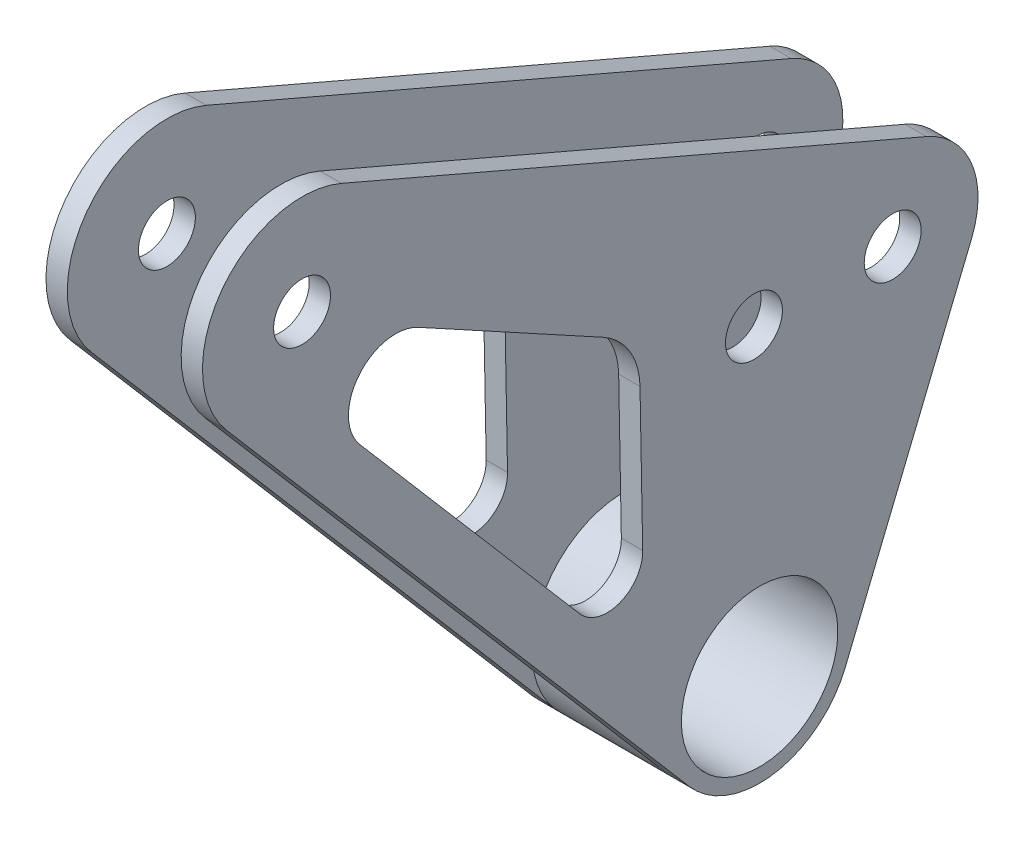
ISO-10303-21;
HEADER;
FILE_DESCRIPTION(('STEP AP214'),'2;1');
FILE_NAME('part.step','',(''),(''),'','','');
FILE_SCHEMA(('AUTOMOTIVE_DESIGN { 1 0 10303 214 1 1 1 1 }'));
ENDSEC;
DATA;
#1=APPLICATION_CONTEXT('core data for automotive mechanical design processes');
#2=APPLICATION_PROTOCOL_DEFINITION('international standard','automotive_design',2000,#1);
#3=PRODUCT_CONTEXT('',#1,'mechanical');
#4=PRODUCT('Part','Part','',(#3));
#5=PRODUCT_RELATED_PRODUCT_CATEGORY('part','',(#4));
#6=PRODUCT_DEFINITION_FORMATION('','',#4);
#7=PRODUCT_DEFINITION_CONTEXT('part definition',#1,'design');
#8=PRODUCT_DEFINITION('design','',#6,#7);
#9=PRODUCT_DEFINITION_SHAPE('','',#8);
#10=(LENGTH_UNIT() NAMED_UNIT(*) SI_UNIT(.MILLI.,.METRE.));
#11=(NAMED_UNIT(*) PLANE_ANGLE_UNIT() SI_UNIT($,.RADIAN.));
#12=(NAMED_UNIT(*) SI_UNIT($,.STERADIAN.) SOLID_ANGLE_UNIT());
#13=UNCERTAINTY_MEASURE_WITH_UNIT(LENGTH_MEASURE(1.E-05),#10,'distance_accuracy_value','');
#14=(GEOMETRIC_REPRESENTATION_CONTEXT(3) GLOBAL_UNCERTAINTY_ASSIGNED_CONTEXT((#13)) GLOBAL_UNIT_ASSIGNED_CONTEXT((#10,
#11,#12)) REPRESENTATION_CONTEXT('',''));
#15=CARTESIAN_POINT('',(0.,0.,0.));
#16=DIRECTION('',(0.,0.,1.));
#17=DIRECTION('',(1.,0.,0.));
#18=AXIS2_PLACEMENT_3D('',#15,#16,#17);
#19=CARTESIAN_POINT('',(698.53,233.678319405685,-100.647814507726));
#20=DIRECTION('',(0.,-0.918432058408451,0.395578758387778));
#21=DIRECTION('',(0.,-0.395578758387778,-0.918432058408451));
#22=AXIS2_PLACEMENT_3D('',#19,#20,#21);
#23=PLANE('',#22);
#24=DIRECTION('',(0.,-0.395578758387778,-0.918432058408451));
#25=VECTOR('',#24,1.);
#26=CARTESIAN_POINT('',(717.53,233.678319405685,-100.647814507726));
#27=LINE('',#26,#25);
#28=CARTESIAN_POINT('',(717.53,381.468048817716,242.481897382572));
#29=VERTEX_POINT('',#28);
#30=CARTESIAN_POINT('',(717.53,346.051184700902,160.253054899347));
#31=VERTEX_POINT('',#30);
#32=EDGE_CURVE('E436',#29,#31,#27,.T.);
#33=ORIENTED_EDGE('',*,*,#32,.F.);
#34=DIRECTION('',(1.,0.,0.));
#35=VECTOR('',#34,1.);
#36=CARTESIAN_POINT('',(698.53,381.468048817716,242.481897382572));
#37=LINE('',#36,#35);
#38=CARTESIAN_POINT('',(720.53,381.468048817716,242.481897382572));
#39=VERTEX_POINT('',#38);
#40=EDGE_CURVE('E439',#29,#39,#37,.T.);
#41=ORIENTED_EDGE('',*,*,#40,.T.);
#42=DIRECTION('',(0.,-0.395578758387778,-0.918432058408451));
#43=VECTOR('',#42,1.);
#44=CARTESIAN_POINT('',(720.53,233.678319405685,-100.647814507726));
#45=LINE('',#44,#43);
#46=CARTESIAN_POINT('',(720.53,346.051184700902,160.253054899347));
#47=VERTEX_POINT('',#46);
#48=EDGE_CURVE('E475',#39,#47,#45,.T.);
#49=ORIENTED_EDGE('',*,*,#48,.T.);
#50=DIRECTION('',(1.,0.,0.));
#51=VECTOR('',#50,1.);
#52=CARTESIAN_POINT('',(698.53,346.051184700902,160.253054899347));
#53=LINE('',#52,#51);
#54=EDGE_CURVE('E441',#31,#47,#53,.T.);
#55=ORIENTED_EDGE('',*,*,#54,.F.);
#56=EDGE_LOOP('',(#33,#41,#49,#55));
#57=FACE_BOUND('',#56,.T.);
#58=ADVANCED_FACE('F91',(#57),#23,.F.);
#59=CARTESIAN_POINT('',(698.53,335.03,165.));
#60=DIRECTION('',(1.,0.,0.));
#61=DIRECTION('',(0.,0.,-1.));
#62=AXIS2_PLACEMENT_3D('',#59,#60,#61);
#63=CYLINDRICAL_SURFACE('',#62,12.);
#64=CARTESIAN_POINT('',(717.53,335.03,165.));
#65=DIRECTION('',(-1.,0.,0.));
#66=DIRECTION('',(0.,0.,1.));
#67=AXIS2_PLACEMENT_3D('',#64,#65,#66);
#68=CIRCLE('',#67,12.);
#69=CARTESIAN_POINT('',(717.53,330.479226272905,153.896376335413));
#70=VERTEX_POINT('',#69);
#71=EDGE_CURVE('E444',#31,#70,#68,.T.);
#72=ORIENTED_EDGE('',*,*,#71,.F.);
#73=ORIENTED_EDGE('',*,*,#54,.T.);
#74=CARTESIAN_POINT('',(720.53,335.03,165.));
#75=DIRECTION('',(-1.,0.,0.));
#76=DIRECTION('',(0.,0.,1.));
#77=AXIS2_PLACEMENT_3D('',#74,#75,#76);
#78=CIRCLE('',#77,12.);
#79=CARTESIAN_POINT('',(720.53,330.479226272905,153.896376335413));
#80=VERTEX_POINT('',#79);
#81=EDGE_CURVE('E477',#47,#80,#78,.T.);
#82=ORIENTED_EDGE('',*,*,#81,.T.);
#83=DIRECTION('',(1.,0.,0.));
#84=VECTOR('',#83,1.);
#85=CARTESIAN_POINT('',(698.53,330.479226272905,153.896376335413));
#86=LINE('',#85,#84);
#87=EDGE_CURVE('E496',#70,#80,#86,.T.);
#88=ORIENTED_EDGE('',*,*,#87,.F.);
#89=EDGE_LOOP('',(#72,#73,#82,#88));
#90=FACE_BOUND('',#89,.T.);
#91=ADVANCED_FACE('F533',(#90),#63,.T.);
#92=CARTESIAN_POINT('',(698.53,101.531036716129,247.729834436482));
#93=DIRECTION('',(0.,0.379231143924627,0.925301972048919));
#94=DIRECTION('',(0.,-0.925301972048919,0.379231143924627));
#95=AXIS2_PLACEMENT_3D('',#92,#93,#94);
#96=PLANE('',#95);
#97=DIRECTION('',(0.,-0.925301972048919,0.379231143924627));
#98=VECTOR('',#97,1.);
#99=CARTESIAN_POINT('',(717.53,101.531036716129,247.729834436482));
#100=LINE('',#99,#98);
#101=CARTESIAN_POINT('',(717.53,287.109995128982,171.671074363369));
#102=VERTEX_POINT('',#101);
#103=EDGE_CURVE('E482',#70,#102,#100,.T.);
#104=ORIENTED_EDGE('',*,*,#103,.F.);
#105=ORIENTED_EDGE('',*,*,#87,.T.);
#106=DIRECTION('',(0.,-0.925301972048919,0.379231143924627));
#107=VECTOR('',#106,1.);
#108=CARTESIAN_POINT('',(720.53,101.531036716129,247.729834436482));
#109=LINE('',#108,#107);
#110=CARTESIAN_POINT('',(720.53,287.109995128982,171.671074363369));
#111=VERTEX_POINT('',#110);
#112=EDGE_CURVE('E474',#80,#111,#109,.T.);
#113=ORIENTED_EDGE('',*,*,#112,.T.);
#114=DIRECTION('',(1.,0.,0.));
#115=VECTOR('',#114,1.);
#116=CARTESIAN_POINT('',(698.53,287.109995128982,171.671074363369));
#117=LINE('',#116,#115);
#118=EDGE_CURVE('E467',#102,#111,#117,.T.);
#119=ORIENTED_EDGE('',*,*,#118,.F.);
#120=EDGE_LOOP('',(#104,#105,#113,#119));
#121=FACE_BOUND('',#120,.T.);
#122=ADVANCED_FACE('F538',(#121),#96,.F.);
#123=CARTESIAN_POINT('',(698.53,335.03,165.));
#124=DIRECTION('',(1.,0.,0.));
#125=DIRECTION('',(0.,0.,-1.));
#126=AXIS2_PLACEMENT_3D('',#123,#124,#125);
#127=CYLINDRICAL_SURFACE('',#126,3.99999999999494);
#128=CARTESIAN_POINT('',(720.53,335.03,165.));
#129=DIRECTION('',(-1.,0.,0.));
#130=DIRECTION('',(0.,0.,1.));
#131=AXIS2_PLACEMENT_3D('',#128,#129,#130);
#132=CIRCLE('',#131,3.99999999999494);
#133=CARTESIAN_POINT('',(720.53,335.03,168.999999999995));
#134=VERTEX_POINT('',#133);
#135=EDGE_CURVE('E489',#134,#134,#132,.T.);
#136=ORIENTED_EDGE('',*,*,#135,.F.);
#137=EDGE_LOOP('',(#136));
#138=FACE_BOUND('',#137,.T.);
#139=CARTESIAN_POINT('',(717.53,335.03,165.));
#140=DIRECTION('',(-1.,0.,0.));
#141=DIRECTION('',(0.,0.,1.));
#142=AXIS2_PLACEMENT_3D('',#139,#140,#141);
#143=CIRCLE('',#142,3.99999999999494);
#144=CARTESIAN_POINT('',(717.53,335.03,168.999999999995));
#145=VERTEX_POINT('',#144);
#146=EDGE_CURVE('E478',#145,#145,#143,.T.);
#147=ORIENTED_EDGE('',*,*,#146,.T.);
#148=EDGE_LOOP('',(#147));
#149=FACE_BOUND('',#148,.T.);
#150=ADVANCED_FACE('F603',(#138,#149),#127,.F.);
#151=CARTESIAN_POINT('',(698.53,368.61,248.02));
#152=DIRECTION('',(1.,0.,0.));
#153=DIRECTION('',(0.,0.,-1.));
#154=AXIS2_PLACEMENT_3D('',#151,#152,#153);
#155=CYLINDRICAL_SURFACE('',#154,13.999999999995);
#156=ORIENTED_EDGE('',*,*,#40,.F.);
#157=CARTESIAN_POINT('',(717.53,368.61,248.02));
#158=DIRECTION('',(-1.,0.,0.));
#159=DIRECTION('',(0.,0.,1.));
#160=AXIS2_PLACEMENT_3D('',#157,#158,#159);
#161=CIRCLE('',#160,13.999999999995);
#162=CARTESIAN_POINT('',(717.53,359.498464833591,258.649201612126));
#163=VERTEX_POINT('',#162);
#164=EDGE_CURVE('E251',#163,#29,#161,.T.);
#165=ORIENTED_EDGE('',*,*,#164,.F.);
#166=DIRECTION('',(1.,0.,0.));
#167=VECTOR('',#166,1.);
#168=CARTESIAN_POINT('',(698.53,359.498464833591,258.649201612126));
#169=LINE('',#168,#167);
#170=CARTESIAN_POINT('',(720.53,359.498464833591,258.649201612126));
#171=VERTEX_POINT('',#170);
#172=EDGE_CURVE('E290',#163,#171,#169,.T.);
#173=ORIENTED_EDGE('',*,*,#172,.T.);
#174=CARTESIAN_POINT('',(720.53,368.61,248.02));
#175=DIRECTION('',(-1.,0.,0.));
#176=DIRECTION('',(0.,0.,1.));
#177=AXIS2_PLACEMENT_3D('',#174,#175,#176);
#178=CIRCLE('',#177,13.999999999995);
#179=EDGE_CURVE('E298',#171,#39,#178,.T.);
#180=ORIENTED_EDGE('',*,*,#179,.T.);
#181=EDGE_LOOP('',(#156,#165,#173,#180));
#182=FACE_BOUND('',#181,.T.);
#183=ADVANCED_FACE('F449',(#182),#155,.T.);
#184=CARTESIAN_POINT('',(698.53,381.468048817716,242.481897382572));
#185=VERTEX_POINT('',#184);
#186=CARTESIAN_POINT('',(701.53,381.468048817716,242.481897382572));
#187=VERTEX_POINT('',#186);
#188=EDGE_CURVE('E452',#185,#187,#37,.T.);
#189=ORIENTED_EDGE('',*,*,#188,.F.);
#190=CARTESIAN_POINT('',(698.53,368.61,248.02));
#191=DIRECTION('',(-1.,0.,0.));
#192=DIRECTION('',(0.,0.,1.));
#193=AXIS2_PLACEMENT_3D('',#190,#191,#192);
#194=CIRCLE('',#193,13.999999999995);
#195=CARTESIAN_POINT('',(698.53,359.498464833591,258.649201612126));
#196=VERTEX_POINT('',#195);
#197=EDGE_CURVE('E281',#196,#185,#194,.T.);
#198=ORIENTED_EDGE('',*,*,#197,.F.);
#199=CARTESIAN_POINT('',(701.53,359.498464833591,258.649201612126));
#200=VERTEX_POINT('',#199);
#201=EDGE_CURVE('E306',#196,#200,#169,.T.);
#202=ORIENTED_EDGE('',*,*,#201,.T.);
#203=CARTESIAN_POINT('',(701.53,368.61,248.02));
#204=DIRECTION('',(-1.,0.,0.));
#205=DIRECTION('',(0.,0.,1.));
#206=AXIS2_PLACEMENT_3D('',#203,#204,#205);
#207=CIRCLE('',#206,13.999999999995);
#208=EDGE_CURVE('E264',#200,#187,#207,.T.);
#209=ORIENTED_EDGE('',*,*,#208,.T.);
#210=EDGE_LOOP('',(#189,#198,#202,#209));
#211=FACE_BOUND('',#210,.T.);
#212=ADVANCED_FACE('F556',(#211),#155,.T.);
#213=CARTESIAN_POINT('',(720.53,0.,0.));
#214=DIRECTION('',(-1.,0.,0.));
#215=DIRECTION('',(0.,0.,1.));
#216=AXIS2_PLACEMENT_3D('',#213,#214,#215);
#217=PLANE('',#216);
#218=CARTESIAN_POINT('',(720.53,368.61,248.02));
#219=DIRECTION('',(-1.,0.,0.));
#220=DIRECTION('',(0.,0.,1.));
#221=AXIS2_PLACEMENT_3D('',#218,#219,#220);
#222=CIRCLE('',#221,3.99999999999506);
#223=CARTESIAN_POINT('',(720.53,368.61,252.019999999995));
#224=VERTEX_POINT('',#223);
#225=EDGE_CURVE('E301',#224,#224,#222,.T.);
#226=ORIENTED_EDGE('',*,*,#225,.T.);
#227=EDGE_LOOP('',(#226));
#228=FACE_BOUND('',#227,.T.);
#229=CARTESIAN_POINT('',(720.53,292.04,183.7));
#230=DIRECTION('',(-1.,0.,0.));
#231=DIRECTION('',(0.,0.,1.));
#232=AXIS2_PLACEMENT_3D('',#229,#230,#231);
#233=CIRCLE('',#232,10.9999999999949);
#234=CARTESIAN_POINT('',(720.53,292.04,194.699999999995));
#235=VERTEX_POINT('',#234);
#236=EDGE_CURVE('E276',#235,#235,#233,.T.);
#237=ORIENTED_EDGE('',*,*,#236,.T.);
#238=EDGE_LOOP('',(#237));
#239=FACE_BOUND('',#238,.T.);
#240=ORIENTED_EDGE('',*,*,#48,.F.);
#241=ORIENTED_EDGE('',*,*,#179,.F.);
#242=DIRECTION('',(0.,-0.759228686580562,-0.650823940457905));
#243=VECTOR('',#242,1.);
#244=CARTESIAN_POINT('',(720.53,24.4685811242566,-28.5441999819317));
#245=LINE('',#244,#243);
#246=CARTESIAN_POINT('',(720.53,283.579288774049,193.569972925545));
#247=VERTEX_POINT('',#246);
#248=EDGE_CURVE('E295',#171,#247,#245,.T.);
#249=ORIENTED_EDGE('',*,*,#248,.T.);
#250=CARTESIAN_POINT('',(720.53,292.04,183.7));
#251=DIRECTION('',(-1.,0.,0.));
#252=DIRECTION('',(0.,0.,1.));
#253=AXIS2_PLACEMENT_3D('',#250,#251,#252);
#254=CIRCLE('',#253,12.999999999995);
#255=EDGE_CURVE('E293',#111,#247,#254,.T.);
#256=ORIENTED_EDGE('',*,*,#255,.F.);
#257=ORIENTED_EDGE('',*,*,#112,.F.);
#258=ORIENTED_EDGE('',*,*,#81,.F.);
#259=EDGE_LOOP('',(#240,#241,#249,#256,#257,#258));
#260=FACE_BOUND('',#259,.T.);
#261=CARTESIAN_POINT('',(720.53,335.03,184.5));
#262=DIRECTION('',(-1.,0.,0.));
#263=DIRECTION('',(0.,0.,1.));
#264=AXIS2_PLACEMENT_3D('',#261,#262,#263);
#265=CIRCLE('',#264,3.99999999999504);
#266=CARTESIAN_POINT('',(720.53,335.03,188.499999999995));
#267=VERTEX_POINT('',#266);
#268=EDGE_CURVE('E260',#267,#267,#265,.T.);
#269=ORIENTED_EDGE('',*,*,#268,.T.);
#270=EDGE_LOOP('',(#269));
#271=FACE_BOUND('',#270,.T.);
#272=CARTESIAN_POINT('',(720.53,352.707355583537,234.859422541208));
#273=DIRECTION('',(-1.,0.,0.));
#274=DIRECTION('',(0.,0.,1.));
#275=AXIS2_PLACEMENT_3D('',#272,#273,#274);
#276=CIRCLE('',#275,6.64206623585444);
#277=CARTESIAN_POINT('',(720.53,358.535602781439,231.673739179411));
#278=VERTEX_POINT('',#277);
#279=CARTESIAN_POINT('',(720.53,348.384539863136,239.902269765637));
#280=VERTEX_POINT('',#279);
#281=EDGE_CURVE('E503',#278,#280,#276,.F.);
#282=ORIENTED_EDGE('',*,*,#281,.F.);
#283=DIRECTION('',(0.,-0.479622341704594,-0.877475019210121));
#284=VECTOR('',#283,1.);
#285=CARTESIAN_POINT('',(720.53,178.557508926116,-97.5984144109011));
#286=LINE('',#285,#284);
#287=CARTESIAN_POINT('',(720.53,344.348576126505,205.718398061796));
#288=VERTEX_POINT('',#287);
#289=EDGE_CURVE('E202',#278,#288,#286,.T.);
#290=ORIENTED_EDGE('',*,*,#289,.T.);
#291=CARTESIAN_POINT('',(720.53,335.573825934407,210.514621478842));
#292=DIRECTION('',(-1.,0.,0.));
#293=DIRECTION('',(0.,0.,1.));
#294=AXIS2_PLACEMENT_3D('',#291,#292,#293);
#295=CIRCLE('',#294,9.99999999999882);
#296=CARTESIAN_POINT('',(720.53,335.759883510196,200.516352499739));
#297=VERTEX_POINT('',#296);
#298=EDGE_CURVE('E117',#288,#297,#295,.T.);
#299=ORIENTED_EDGE('',*,*,#298,.T.);
#300=DIRECTION('',(0.,-0.999826897910286,-0.0186057575791589));
#301=VECTOR('',#300,1.);
#302=CARTESIAN_POINT('',(720.53,-3.61388142901527,194.200953291753));
#303=LINE('',#302,#301);
#304=CARTESIAN_POINT('',(720.53,315.608243404824,200.141351055582));
#305=VERTEX_POINT('',#304);
#306=EDGE_CURVE('E507',#297,#305,#303,.T.);
#307=ORIENTED_EDGE('',*,*,#306,.T.);
#308=CARTESIAN_POINT('',(720.53,315.515214616924,205.140485545134));
#309=DIRECTION('',(-1.,0.,0.));
#310=DIRECTION('',(0.,0.,1.));
#311=AXIS2_PLACEMENT_3D('',#308,#309,#310);
#312=CIRCLE('',#311,4.99999999999998);
#313=CARTESIAN_POINT('',(720.53,312.261094914634,208.936628978036));
#314=VERTEX_POINT('',#313);
#315=EDGE_CURVE('E509',#305,#314,#312,.T.);
#316=ORIENTED_EDGE('',*,*,#315,.T.);
#317=DIRECTION('',(0.,-0.759228686580597,-0.650823940457864));
#318=VECTOR('',#317,1.);
#319=CARTESIAN_POINT('',(720.53,29.0243487074469,-33.8588007879818));
#320=LINE('',#319,#318);
#321=EDGE_CURVE('E346',#280,#314,#320,.T.);
#322=ORIENTED_EDGE('',*,*,#321,.F.);
#323=EDGE_LOOP('',(#282,#290,#299,#307,#316,#322));
#324=FACE_BOUND('',#323,.T.);
#325=ORIENTED_EDGE('',*,*,#135,.T.);
#326=EDGE_LOOP('',(#325));
#327=FACE_BOUND('',#326,.T.);
#328=ADVANCED_FACE('F471',(#228,#239,#260,#271,#324,#327),#217,.F.);
#329=CARTESIAN_POINT('',(698.53,0.,0.));
#330=DIRECTION('',(-1.,0.,0.));
#331=DIRECTION('',(0.,0.,1.));
#332=AXIS2_PLACEMENT_3D('',#329,#330,#331);
#333=PLANE('',#332);
#334=DIRECTION('',(0.,-0.925301972048919,0.379231143924627));
#335=VECTOR('',#334,1.);
#336=CARTESIAN_POINT('',(698.53,101.531036716129,247.729834436482));
#337=LINE('',#336,#335);
#338=CARTESIAN_POINT('',(698.53,330.479226272905,153.896376335413));
#339=VERTEX_POINT('',#338);
#340=CARTESIAN_POINT('',(698.53,287.109995128982,171.671074363369));
#341=VERTEX_POINT('',#340);
#342=EDGE_CURVE('E567',#339,#341,#337,.T.);
#343=ORIENTED_EDGE('',*,*,#342,.T.);
#344=CARTESIAN_POINT('',(698.53,292.04,183.7));
#345=DIRECTION('',(-1.,0.,0.));
#346=DIRECTION('',(0.,0.,1.));
#347=AXIS2_PLACEMENT_3D('',#344,#345,#346);
#348=CIRCLE('',#347,12.999999999995);
#349=CARTESIAN_POINT('',(698.53,283.579288774049,193.569972925545));
#350=VERTEX_POINT('',#349);
#351=EDGE_CURVE('E275',#341,#350,#348,.T.);
#352=ORIENTED_EDGE('',*,*,#351,.T.);
#353=DIRECTION('',(0.,-0.759228686580562,-0.650823940457905));
#354=VECTOR('',#353,1.);
#355=CARTESIAN_POINT('',(698.53,24.4685811242566,-28.5441999819317));
#356=LINE('',#355,#354);
#357=EDGE_CURVE('E278',#196,#350,#356,.T.);
#358=ORIENTED_EDGE('',*,*,#357,.F.);
#359=ORIENTED_EDGE('',*,*,#197,.T.);
#360=DIRECTION('',(0.,-0.395578758387778,-0.918432058408451));
#361=VECTOR('',#360,1.);
#362=CARTESIAN_POINT('',(698.53,233.678319405685,-100.647814507726));
#363=LINE('',#362,#361);
#364=CARTESIAN_POINT('',(698.53,346.051184700902,160.253054899347));
#365=VERTEX_POINT('',#364);
#366=EDGE_CURVE('E492',#185,#365,#363,.T.);
#367=ORIENTED_EDGE('',*,*,#366,.T.);
#368=CARTESIAN_POINT('',(698.53,335.03,165.));
#369=DIRECTION('',(-1.,0.,0.));
#370=DIRECTION('',(0.,0.,1.));
#371=AXIS2_PLACEMENT_3D('',#368,#369,#370);
#372=CIRCLE('',#371,12.);
#373=EDGE_CURVE('E579',#365,#339,#372,.T.);
#374=ORIENTED_EDGE('',*,*,#373,.T.);
#375=EDGE_LOOP('',(#343,#352,#358,#359,#367,#374));
#376=FACE_BOUND('',#375,.T.);
#377=CARTESIAN_POINT('',(698.53,335.03,184.5));
#378=DIRECTION('',(-1.,0.,0.));
#379=DIRECTION('',(0.,0.,1.));
#380=AXIS2_PLACEMENT_3D('',#377,#378,#379);
#381=CIRCLE('',#380,3.99999999999504);
#382=CARTESIAN_POINT('',(698.53,335.03,188.499999999995));
#383=VERTEX_POINT('',#382);
#384=EDGE_CURVE('E272',#383,#383,#381,.T.);
#385=ORIENTED_EDGE('',*,*,#384,.F.);
#386=EDGE_LOOP('',(#385));
#387=FACE_BOUND('',#386,.T.);
#388=CARTESIAN_POINT('',(698.53,292.04,183.7));
#389=DIRECTION('',(-1.,0.,0.));
#390=DIRECTION('',(0.,0.,1.));
#391=AXIS2_PLACEMENT_3D('',#388,#389,#390);
#392=CIRCLE('',#391,10.9999999999949);
#393=CARTESIAN_POINT('',(698.53,292.04,194.699999999995));
#394=VERTEX_POINT('',#393);
#395=EDGE_CURVE('E287',#394,#394,#392,.T.);
#396=ORIENTED_EDGE('',*,*,#395,.F.);
#397=EDGE_LOOP('',(#396));
#398=FACE_BOUND('',#397,.T.);
#399=CARTESIAN_POINT('',(698.53,368.61,248.02));
#400=DIRECTION('',(-1.,0.,0.));
#401=DIRECTION('',(0.,0.,1.));
#402=AXIS2_PLACEMENT_3D('',#399,#400,#401);
#403=CIRCLE('',#402,3.99999999999506);
#404=CARTESIAN_POINT('',(698.53,368.61,252.019999999995));
#405=VERTEX_POINT('',#404);
#406=EDGE_CURVE('E284',#405,#405,#403,.T.);
#407=ORIENTED_EDGE('',*,*,#406,.F.);
#408=EDGE_LOOP('',(#407));
#409=FACE_BOUND('',#408,.T.);
#410=DIRECTION('',(0.,0.479622341704594,0.877475019210121));
#411=VECTOR('',#410,1.);
#412=CARTESIAN_POINT('',(698.53,178.557508926116,-97.5984144109011));
#413=LINE('',#412,#411);
#414=CARTESIAN_POINT('',(698.53,358.535602781439,231.673739179411));
#415=VERTEX_POINT('',#414);
#416=CARTESIAN_POINT('',(698.53,344.348576126506,205.718398061796));
#417=VERTEX_POINT('',#416);
#418=EDGE_CURVE('E223',#415,#417,#413,.F.);
#419=ORIENTED_EDGE('',*,*,#418,.F.);
#420=CARTESIAN_POINT('',(698.53,352.707355583537,234.859422541208));
#421=DIRECTION('',(-1.,0.,0.));
#422=DIRECTION('',(0.,0.,1.));
#423=AXIS2_PLACEMENT_3D('',#420,#421,#422);
#424=CIRCLE('',#423,6.64206623585444);
#425=CARTESIAN_POINT('',(698.53,348.384539863136,239.902269765637));
#426=VERTEX_POINT('',#425);
#427=EDGE_CURVE('E95',#415,#426,#424,.F.);
#428=ORIENTED_EDGE('',*,*,#427,.T.);
#429=DIRECTION('',(0.,-0.759228686580597,-0.650823940457864));
#430=VECTOR('',#429,1.);
#431=CARTESIAN_POINT('',(698.53,348.384539863136,239.902269765637));
#432=LINE('',#431,#430);
#433=CARTESIAN_POINT('',(698.53,312.261094914634,208.936628978037));
#434=VERTEX_POINT('',#433);
#435=EDGE_CURVE('E152',#426,#434,#432,.T.);
#436=ORIENTED_EDGE('',*,*,#435,.T.);
#437=CARTESIAN_POINT('',(698.53,315.515214616924,205.140485545134));
#438=DIRECTION('',(-1.,0.,0.));
#439=DIRECTION('',(0.,0.,1.));
#440=AXIS2_PLACEMENT_3D('',#437,#438,#439);
#441=CIRCLE('',#440,4.99999999999998);
#442=CARTESIAN_POINT('',(698.53,315.608243404822,200.141351055582));
#443=VERTEX_POINT('',#442);
#444=EDGE_CURVE('E241',#443,#434,#441,.T.);
#445=ORIENTED_EDGE('',*,*,#444,.F.);
#446=DIRECTION('',(0.,0.999826897910286,0.0186057575791589));
#447=VECTOR('',#446,1.);
#448=CARTESIAN_POINT('',(698.53,-3.61388142901527,194.200953291753));
#449=LINE('',#448,#447);
#450=CARTESIAN_POINT('',(698.53,335.759883510197,200.516352499739));
#451=VERTEX_POINT('',#450);
#452=EDGE_CURVE('E237',#451,#443,#449,.F.);
#453=ORIENTED_EDGE('',*,*,#452,.F.);
#454=CARTESIAN_POINT('',(698.53,335.573825934407,210.514621478842));
#455=DIRECTION('',(-1.,0.,0.));
#456=DIRECTION('',(0.,0.,1.));
#457=AXIS2_PLACEMENT_3D('',#454,#455,#456);
#458=CIRCLE('',#457,9.99999999999882);
#459=EDGE_CURVE('E233',#417,#451,#458,.T.);
#460=ORIENTED_EDGE('',*,*,#459,.F.);
#461=EDGE_LOOP('',(#419,#428,#436,#445,#453,#460));
#462=FACE_BOUND('',#461,.T.);
#463=CARTESIAN_POINT('',(698.53,335.03,165.));
#464=DIRECTION('',(-1.,0.,0.));
#465=DIRECTION('',(0.,0.,1.));
#466=AXIS2_PLACEMENT_3D('',#463,#464,#465);
#467=CIRCLE('',#466,3.99999999999494);
#468=CARTESIAN_POINT('',(698.53,335.03,168.999999999995));
#469=VERTEX_POINT('',#468);
#470=EDGE_CURVE('E485',#469,#469,#467,.T.);
#471=ORIENTED_EDGE('',*,*,#470,.F.);
#472=EDGE_LOOP('',(#471));
#473=FACE_BOUND('',#472,.T.);
#474=ADVANCED_FACE('F333',(#376,#387,#398,#409,#462,#473),#333,.T.);
#475=CARTESIAN_POINT('',(717.53,0.,0.));
#476=DIRECTION('',(-1.,0.,0.));
#477=DIRECTION('',(0.,0.,1.));
#478=AXIS2_PLACEMENT_3D('',#475,#476,#477);
#479=PLANE('',#478);
#480=ORIENTED_EDGE('',*,*,#103,.T.);
#481=CARTESIAN_POINT('',(717.53,292.04,183.7));
#482=DIRECTION('',(-1.,0.,0.));
#483=DIRECTION('',(0.,0.,1.));
#484=AXIS2_PLACEMENT_3D('',#481,#482,#483);
#485=CIRCLE('',#484,12.999999999995);
#486=CARTESIAN_POINT('',(717.53,283.579288774047,193.569972925547));
#487=VERTEX_POINT('',#486);
#488=EDGE_CURVE('E244',#487,#102,#485,.T.);
#489=ORIENTED_EDGE('',*,*,#488,.F.);
#490=DIRECTION('',(0.,-0.759228686580562,-0.650823940457905));
#491=VECTOR('',#490,1.);
#492=CARTESIAN_POINT('',(717.53,24.4685811242566,-28.5441999819317));
#493=LINE('',#492,#491);
#494=EDGE_CURVE('E247',#163,#487,#493,.T.);
#495=ORIENTED_EDGE('',*,*,#494,.F.);
#496=ORIENTED_EDGE('',*,*,#164,.T.);
#497=ORIENTED_EDGE('',*,*,#32,.T.);
#498=ORIENTED_EDGE('',*,*,#71,.T.);
#499=EDGE_LOOP('',(#480,#489,#495,#496,#497,#498));
#500=FACE_BOUND('',#499,.T.);
#501=CARTESIAN_POINT('',(717.53,335.03,184.5));
#502=DIRECTION('',(-1.,0.,0.));
#503=DIRECTION('',(0.,0.,1.));
#504=AXIS2_PLACEMENT_3D('',#501,#502,#503);
#505=CIRCLE('',#504,3.99999999999504);
#506=CARTESIAN_POINT('',(717.53,335.03,188.499999999995));
#507=VERTEX_POINT('',#506);
#508=EDGE_CURVE('E254',#507,#507,#505,.T.);
#509=ORIENTED_EDGE('',*,*,#508,.F.);
#510=EDGE_LOOP('',(#509));
#511=FACE_BOUND('',#510,.T.);
#512=CARTESIAN_POINT('',(717.53,368.61,248.02));
#513=DIRECTION('',(-1.,0.,0.));
#514=DIRECTION('',(0.,0.,1.));
#515=AXIS2_PLACEMENT_3D('',#512,#513,#514);
#516=CIRCLE('',#515,3.99999999999506);
#517=CARTESIAN_POINT('',(717.53,368.61,252.019999999995));
#518=VERTEX_POINT('',#517);
#519=EDGE_CURVE('E257',#518,#518,#516,.T.);
#520=ORIENTED_EDGE('',*,*,#519,.F.);
#521=EDGE_LOOP('',(#520));
#522=FACE_BOUND('',#521,.T.);
#523=DIRECTION('',(0.,-0.479622341704594,-0.877475019210121));
#524=VECTOR('',#523,1.);
#525=CARTESIAN_POINT('',(717.53,178.557508926116,-97.598414410901));
#526=LINE('',#525,#524);
#527=CARTESIAN_POINT('',(717.53,358.535602781439,231.673739179411));
#528=VERTEX_POINT('',#527);
#529=CARTESIAN_POINT('',(717.53,344.348576126505,205.718398061796));
#530=VERTEX_POINT('',#529);
#531=EDGE_CURVE('E199',#528,#530,#526,.T.);
#532=ORIENTED_EDGE('',*,*,#531,.F.);
#533=CARTESIAN_POINT('',(717.53,352.707355583537,234.859422541208));
#534=DIRECTION('',(-1.,0.,0.));
#535=DIRECTION('',(0.,0.,1.));
#536=AXIS2_PLACEMENT_3D('',#533,#534,#535);
#537=CIRCLE('',#536,6.64206623585444);
#538=CARTESIAN_POINT('',(717.53,348.384539863136,239.902269765637));
#539=VERTEX_POINT('',#538);
#540=EDGE_CURVE('E210',#528,#539,#537,.F.);
#541=ORIENTED_EDGE('',*,*,#540,.T.);
#542=DIRECTION('',(0.,-0.759228686580597,-0.650823940457864));
#543=VECTOR('',#542,1.);
#544=CARTESIAN_POINT('',(717.53,29.0243487074469,-33.8588007879818));
#545=LINE('',#544,#543);
#546=CARTESIAN_POINT('',(717.53,312.261094914634,208.936628978036));
#547=VERTEX_POINT('',#546);
#548=EDGE_CURVE('E242',#539,#547,#545,.T.);
#549=ORIENTED_EDGE('',*,*,#548,.T.);
#550=CARTESIAN_POINT('',(717.53,315.515214616924,205.140485545134));
#551=DIRECTION('',(-1.,0.,0.));
#552=DIRECTION('',(0.,0.,1.));
#553=AXIS2_PLACEMENT_3D('',#550,#551,#552);
#554=CIRCLE('',#553,4.99999999999998);
#555=CARTESIAN_POINT('',(717.53,315.608243404824,200.141351055582));
#556=VERTEX_POINT('',#555);
#557=EDGE_CURVE('E238',#556,#547,#554,.T.);
#558=ORIENTED_EDGE('',*,*,#557,.F.);
#559=DIRECTION('',(0.,-0.999826897910286,-0.0186057575791589));
#560=VECTOR('',#559,1.);
#561=CARTESIAN_POINT('',(717.53,-3.61388142901527,194.200953291753));
#562=LINE('',#561,#560);
#563=CARTESIAN_POINT('',(717.53,335.759883510196,200.516352499739));
#564=VERTEX_POINT('',#563);
#565=EDGE_CURVE('E234',#564,#556,#562,.T.);
#566=ORIENTED_EDGE('',*,*,#565,.F.);
#567=CARTESIAN_POINT('',(717.53,335.573825934407,210.514621478842));
#568=DIRECTION('',(-1.,0.,0.));
#569=DIRECTION('',(0.,0.,1.));
#570=AXIS2_PLACEMENT_3D('',#567,#568,#569);
#571=CIRCLE('',#570,9.99999999999882);
#572=EDGE_CURVE('E222',#530,#564,#571,.T.);
#573=ORIENTED_EDGE('',*,*,#572,.F.);
#574=EDGE_LOOP('',(#532,#541,#549,#558,#566,#573));
#575=FACE_BOUND('',#574,.T.);
#576=ORIENTED_EDGE('',*,*,#146,.F.);
#577=EDGE_LOOP('',(#576));
#578=FACE_BOUND('',#577,.T.);
#579=ADVANCED_FACE('F218',(#500,#511,#522,#575,#578),#479,.T.);
#580=CARTESIAN_POINT('',(701.53,0.,0.));
#581=DIRECTION('',(-1.,0.,0.));
#582=DIRECTION('',(0.,0.,1.));
#583=AXIS2_PLACEMENT_3D('',#580,#581,#582);
#584=PLANE('',#583);
#585=CARTESIAN_POINT('',(701.53,292.04,183.7));
#586=DIRECTION('',(-1.,0.,0.));
#587=DIRECTION('',(0.,0.,1.));
#588=AXIS2_PLACEMENT_3D('',#585,#586,#587);
#589=CIRCLE('',#588,12.999999999995);
#590=CARTESIAN_POINT('',(701.53,283.579288774047,193.569972925547));
#591=VERTEX_POINT('',#590);
#592=CARTESIAN_POINT('',(701.53,287.109995128982,171.671074363369));
#593=VERTEX_POINT('',#592);
#594=EDGE_CURVE('E108',#591,#593,#589,.T.);
#595=ORIENTED_EDGE('',*,*,#594,.T.);
#596=DIRECTION('',(0.,-0.925301972048919,0.379231143924627));
#597=VECTOR('',#596,1.);
#598=CARTESIAN_POINT('',(701.53,101.531036716129,247.729834436482));
#599=LINE('',#598,#597);
#600=CARTESIAN_POINT('',(701.53,330.479226272905,153.896376335413));
#601=VERTEX_POINT('',#600);
#602=EDGE_CURVE('E568',#601,#593,#599,.T.);
#603=ORIENTED_EDGE('',*,*,#602,.F.);
#604=CARTESIAN_POINT('',(701.53,335.03,165.));
#605=DIRECTION('',(-1.,0.,0.));
#606=DIRECTION('',(0.,0.,1.));
#607=AXIS2_PLACEMENT_3D('',#604,#605,#606);
#608=CIRCLE('',#607,12.);
#609=CARTESIAN_POINT('',(701.53,346.051184700902,160.253054899347));
#610=VERTEX_POINT('',#609);
#611=EDGE_CURVE('E571',#610,#601,#608,.T.);
#612=ORIENTED_EDGE('',*,*,#611,.F.);
#613=DIRECTION('',(0.,-0.395578758387778,-0.918432058408451));
#614=VECTOR('',#613,1.);
#615=CARTESIAN_POINT('',(701.53,233.678319405685,-100.647814507726));
#616=LINE('',#615,#614);
#617=EDGE_CURVE('E553',#187,#610,#616,.T.);
#618=ORIENTED_EDGE('',*,*,#617,.F.);
#619=ORIENTED_EDGE('',*,*,#208,.F.);
#620=DIRECTION('',(0.,-0.759228686580562,-0.650823940457905));
#621=VECTOR('',#620,1.);
#622=CARTESIAN_POINT('',(701.53,24.4685811242566,-28.5441999819317));
#623=LINE('',#622,#621);
#624=EDGE_CURVE('E262',#200,#591,#623,.T.);
#625=ORIENTED_EDGE('',*,*,#624,.T.);
#626=EDGE_LOOP('',(#595,#603,#612,#618,#619,#625));
#627=FACE_BOUND('',#626,.T.);
#628=CARTESIAN_POINT('',(701.53,368.61,248.02));
#629=DIRECTION('',(-1.,0.,0.));
#630=DIRECTION('',(0.,0.,1.));
#631=AXIS2_PLACEMENT_3D('',#628,#629,#630);
#632=CIRCLE('',#631,3.99999999999506);
#633=CARTESIAN_POINT('',(701.53,368.61,252.019999999995));
#634=VERTEX_POINT('',#633);
#635=EDGE_CURVE('E248',#634,#634,#632,.T.);
#636=ORIENTED_EDGE('',*,*,#635,.T.);
#637=EDGE_LOOP('',(#636));
#638=FACE_BOUND('',#637,.T.);
#639=CARTESIAN_POINT('',(701.53,335.03,184.5));
#640=DIRECTION('',(-1.,0.,0.));
#641=DIRECTION('',(0.,0.,1.));
#642=AXIS2_PLACEMENT_3D('',#639,#640,#641);
#643=CIRCLE('',#642,3.99999999999504);
#644=CARTESIAN_POINT('',(701.53,335.03,188.499999999995));
#645=VERTEX_POINT('',#644);
#646=EDGE_CURVE('E267',#645,#645,#643,.T.);
#647=ORIENTED_EDGE('',*,*,#646,.T.);
#648=EDGE_LOOP('',(#647));
#649=FACE_BOUND('',#648,.T.);
#650=CARTESIAN_POINT('',(701.53,352.707355583537,234.859422541208));
#651=DIRECTION('',(-1.,0.,0.));
#652=DIRECTION('',(0.,0.,1.));
#653=AXIS2_PLACEMENT_3D('',#650,#651,#652);
#654=CIRCLE('',#653,6.64206623585444);
#655=CARTESIAN_POINT('',(701.53,358.535602781439,231.673739179411));
#656=VERTEX_POINT('',#655);
#657=CARTESIAN_POINT('',(701.53,348.384539863136,239.902269765637));
#658=VERTEX_POINT('',#657);
#659=EDGE_CURVE('E12',#656,#658,#654,.F.);
#660=ORIENTED_EDGE('',*,*,#659,.F.);
#661=DIRECTION('',(0.,-0.479622341704594,-0.877475019210121));
#662=VECTOR('',#661,1.);
#663=CARTESIAN_POINT('',(701.53,178.557508926116,-97.598414410901));
#664=LINE('',#663,#662);
#665=CARTESIAN_POINT('',(701.53,344.348576126505,205.718398061796));
#666=VERTEX_POINT('',#665);
#667=EDGE_CURVE('E313',#656,#666,#664,.T.);
#668=ORIENTED_EDGE('',*,*,#667,.T.);
#669=CARTESIAN_POINT('',(701.53,335.573825934407,210.514621478842));
#670=DIRECTION('',(-1.,0.,0.));
#671=DIRECTION('',(0.,0.,1.));
#672=AXIS2_PLACEMENT_3D('',#669,#670,#671);
#673=CIRCLE('',#672,9.99999999999882);
#674=CARTESIAN_POINT('',(701.53,335.759883510196,200.516352499739));
#675=VERTEX_POINT('',#674);
#676=EDGE_CURVE('E316',#666,#675,#673,.T.);
#677=ORIENTED_EDGE('',*,*,#676,.T.);
#678=DIRECTION('',(0.,-0.999826897910286,-0.0186057575791589));
#679=VECTOR('',#678,1.);
#680=CARTESIAN_POINT('',(701.53,-3.61388142901527,194.200953291753));
#681=LINE('',#680,#679);
#682=CARTESIAN_POINT('',(701.53,315.608243404824,200.141351055582));
#683=VERTEX_POINT('',#682);
#684=EDGE_CURVE('E319',#675,#683,#681,.T.);
#685=ORIENTED_EDGE('',*,*,#684,.T.);
#686=CARTESIAN_POINT('',(701.53,315.515214616924,205.140485545134));
#687=DIRECTION('',(-1.,0.,0.));
#688=DIRECTION('',(0.,0.,1.));
#689=AXIS2_PLACEMENT_3D('',#686,#687,#688);
#690=CIRCLE('',#689,4.99999999999998);
#691=CARTESIAN_POINT('',(701.53,312.261094914634,208.936628978036));
#692=VERTEX_POINT('',#691);
#693=EDGE_CURVE('E322',#683,#692,#690,.T.);
#694=ORIENTED_EDGE('',*,*,#693,.T.);
#695=DIRECTION('',(0.,-0.759228686580597,-0.650823940457864));
#696=VECTOR('',#695,1.);
#697=CARTESIAN_POINT('',(701.53,29.0243487074469,-33.8588007879818));
#698=LINE('',#697,#696);
#699=EDGE_CURVE('E100',#658,#692,#698,.T.);
#700=ORIENTED_EDGE('',*,*,#699,.F.);
#701=EDGE_LOOP('',(#660,#668,#677,#685,#694,#700));
#702=FACE_BOUND('',#701,.T.);
#703=CARTESIAN_POINT('',(701.53,335.03,165.));
#704=DIRECTION('',(-1.,0.,0.));
#705=DIRECTION('',(0.,0.,1.));
#706=AXIS2_PLACEMENT_3D('',#703,#704,#705);
#707=CIRCLE('',#706,3.99999999999494);
#708=CARTESIAN_POINT('',(701.53,335.03,168.999999999995));
#709=VERTEX_POINT('',#708);
#710=EDGE_CURVE('E445',#709,#709,#707,.T.);
#711=ORIENTED_EDGE('',*,*,#710,.T.);
#712=EDGE_LOOP('',(#711));
#713=FACE_BOUND('',#712,.T.);
#714=ADVANCED_FACE('F372',(#627,#638,#649,#702,#713),#584,.F.);
#715=CARTESIAN_POINT('',(698.53,335.03,184.5));
#716=DIRECTION('',(1.,0.,0.));
#717=DIRECTION('',(0.,0.,-1.));
#718=AXIS2_PLACEMENT_3D('',#715,#716,#717);
#719=CYLINDRICAL_SURFACE('',#718,3.99999999999504);
#720=ORIENTED_EDGE('',*,*,#268,.F.);
#721=EDGE_LOOP('',(#720));
#722=FACE_BOUND('',#721,.T.);
#723=ORIENTED_EDGE('',*,*,#508,.T.);
#724=EDGE_LOOP('',(#723));
#725=FACE_BOUND('',#724,.T.);
#726=ADVANCED_FACE('F610',(#722,#725),#719,.F.);
#727=CARTESIAN_POINT('',(698.53,24.4685811242566,-28.5441999819317));
#728=DIRECTION('',(0.,-0.650823940457905,0.759228686580562));
#729=DIRECTION('',(0.,-0.759228686580562,-0.650823940457905));
#730=AXIS2_PLACEMENT_3D('',#727,#728,#729);
#731=PLANE('',#730);
#732=ORIENTED_EDGE('',*,*,#172,.F.);
#733=ORIENTED_EDGE('',*,*,#494,.T.);
#734=DIRECTION('',(1.,0.,0.));
#735=VECTOR('',#734,1.);
#736=CARTESIAN_POINT('',(698.53,283.579288774049,193.569972925545));
#737=LINE('',#736,#735);
#738=EDGE_CURVE('E309',#487,#247,#737,.T.);
#739=ORIENTED_EDGE('',*,*,#738,.T.);
#740=ORIENTED_EDGE('',*,*,#248,.F.);
#741=EDGE_LOOP('',(#732,#733,#739,#740));
#742=FACE_BOUND('',#741,.T.);
#743=ADVANCED_FACE('F460',(#742),#731,.T.);
#744=CARTESIAN_POINT('',(698.53,368.61,248.02));
#745=DIRECTION('',(1.,0.,0.));
#746=DIRECTION('',(0.,0.,-1.));
#747=AXIS2_PLACEMENT_3D('',#744,#745,#746);
#748=CYLINDRICAL_SURFACE('',#747,3.99999999999506);
#749=ORIENTED_EDGE('',*,*,#225,.F.);
#750=EDGE_LOOP('',(#749));
#751=FACE_BOUND('',#750,.T.);
#752=ORIENTED_EDGE('',*,*,#519,.T.);
#753=EDGE_LOOP('',(#752));
#754=FACE_BOUND('',#753,.T.);
#755=ADVANCED_FACE('F600',(#751,#754),#748,.F.);
#756=ORIENTED_EDGE('',*,*,#646,.F.);
#757=EDGE_LOOP('',(#756));
#758=FACE_BOUND('',#757,.T.);
#759=ORIENTED_EDGE('',*,*,#384,.T.);
#760=EDGE_LOOP('',(#759));
#761=FACE_BOUND('',#760,.T.);
#762=ADVANCED_FACE('F93',(#758,#761),#719,.F.);
#763=CARTESIAN_POINT('',(698.53,292.04,183.7));
#764=DIRECTION('',(1.,0.,0.));
#765=DIRECTION('',(0.,0.,-1.));
#766=AXIS2_PLACEMENT_3D('',#763,#764,#765);
#767=CYLINDRICAL_SURFACE('',#766,12.999999999995);
#768=ORIENTED_EDGE('',*,*,#488,.T.);
#769=ORIENTED_EDGE('',*,*,#118,.T.);
#770=ORIENTED_EDGE('',*,*,#255,.T.);
#771=ORIENTED_EDGE('',*,*,#738,.F.);
#772=EDGE_LOOP('',(#768,#769,#770,#771));
#773=FACE_BOUND('',#772,.T.);
#774=ORIENTED_EDGE('',*,*,#351,.F.);
#775=EDGE_CURVE('E493',#341,#593,#117,.T.);
#776=ORIENTED_EDGE('',*,*,#775,.T.);
#777=ORIENTED_EDGE('',*,*,#594,.F.);
#778=EDGE_CURVE('E310',#350,#591,#737,.T.);
#779=ORIENTED_EDGE('',*,*,#778,.F.);
#780=EDGE_LOOP('',(#774,#776,#777,#779));
#781=FACE_BOUND('',#780,.T.);
#782=ADVANCED_FACE('F463',(#773,#781),#767,.T.);
#783=ORIENTED_EDGE('',*,*,#624,.F.);
#784=ORIENTED_EDGE('',*,*,#201,.F.);
#785=ORIENTED_EDGE('',*,*,#357,.T.);
#786=ORIENTED_EDGE('',*,*,#778,.T.);
#787=EDGE_LOOP('',(#783,#784,#785,#786));
#788=FACE_BOUND('',#787,.T.);
#789=ADVANCED_FACE('F560',(#788),#731,.T.);
#790=ORIENTED_EDGE('',*,*,#635,.F.);
#791=EDGE_LOOP('',(#790));
#792=FACE_BOUND('',#791,.T.);
#793=ORIENTED_EDGE('',*,*,#406,.T.);
#794=EDGE_LOOP('',(#793));
#795=FACE_BOUND('',#794,.T.);
#796=ADVANCED_FACE('F526',(#792,#795),#748,.F.);
#797=CARTESIAN_POINT('',(698.53,292.04,183.7));
#798=DIRECTION('',(1.,0.,0.));
#799=DIRECTION('',(0.,0.,-1.));
#800=AXIS2_PLACEMENT_3D('',#797,#798,#799);
#801=CYLINDRICAL_SURFACE('',#800,10.9999999999949);
#802=ORIENTED_EDGE('',*,*,#395,.T.);
#803=EDGE_LOOP('',(#802));
#804=FACE_BOUND('',#803,.T.);
#805=ORIENTED_EDGE('',*,*,#236,.F.);
#806=EDGE_LOOP('',(#805));
#807=FACE_BOUND('',#806,.T.);
#808=ADVANCED_FACE('F518',(#804,#807),#801,.F.);
#809=CARTESIAN_POINT('',(720.53,178.557508926116,-97.5984144109011));
#810=DIRECTION('',(0.,0.877475019210121,-0.479622341704594));
#811=DIRECTION('',(0.,0.479622341704594,0.877475019210121));
#812=AXIS2_PLACEMENT_3D('',#809,#810,#811);
#813=PLANE('',#812);
#814=ORIENTED_EDGE('',*,*,#418,.T.);
#815=DIRECTION('',(-1.,0.,0.));
#816=VECTOR('',#815,1.);
#817=CARTESIAN_POINT('',(720.53,344.348576126505,205.718398061796));
#818=LINE('',#817,#816);
#819=EDGE_CURVE('E188',#666,#417,#818,.T.);
#820=ORIENTED_EDGE('',*,*,#819,.F.);
#821=ORIENTED_EDGE('',*,*,#667,.F.);
#822=DIRECTION('',(-1.,0.,0.));
#823=VECTOR('',#822,1.);
#824=CARTESIAN_POINT('',(720.53,358.535602781439,231.673739179411));
#825=LINE('',#824,#823);
#826=EDGE_CURVE('E206',#656,#415,#825,.T.);
#827=ORIENTED_EDGE('',*,*,#826,.T.);
#828=EDGE_LOOP('',(#814,#820,#821,#827));
#829=FACE_BOUND('',#828,.T.);
#830=ADVANCED_FACE('F516',(#829),#813,.F.);
#831=CARTESIAN_POINT('',(720.53,335.573825934407,210.514621478842));
#832=DIRECTION('',(-1.,0.,0.));
#833=DIRECTION('',(0.,0.,1.));
#834=AXIS2_PLACEMENT_3D('',#831,#832,#833);
#835=CYLINDRICAL_SURFACE('',#834,9.99999999999882);
#836=ORIENTED_EDGE('',*,*,#459,.T.);
#837=DIRECTION('',(-1.,0.,0.));
#838=VECTOR('',#837,1.);
#839=CARTESIAN_POINT('',(720.53,335.759883510196,200.516352499739));
#840=LINE('',#839,#838);
#841=EDGE_CURVE('E354',#675,#451,#840,.T.);
#842=ORIENTED_EDGE('',*,*,#841,.F.);
#843=ORIENTED_EDGE('',*,*,#676,.F.);
#844=ORIENTED_EDGE('',*,*,#819,.T.);
#845=EDGE_LOOP('',(#836,#842,#843,#844));
#846=FACE_BOUND('',#845,.T.);
#847=ADVANCED_FACE('F363',(#846),#835,.F.);
#848=CARTESIAN_POINT('',(720.53,-3.61388142901527,194.200953291753));
#849=DIRECTION('',(0.,0.0186057575791589,-0.999826897910286));
#850=DIRECTION('',(0.,0.999826897910286,0.0186057575791589));
#851=AXIS2_PLACEMENT_3D('',#848,#849,#850);
#852=PLANE('',#851);
#853=ORIENTED_EDGE('',*,*,#452,.T.);
#854=DIRECTION('',(-1.,0.,0.));
#855=VECTOR('',#854,1.);
#856=CARTESIAN_POINT('',(720.53,315.608243404824,200.141351055582));
#857=LINE('',#856,#855);
#858=EDGE_CURVE('E351',#683,#443,#857,.T.);
#859=ORIENTED_EDGE('',*,*,#858,.F.);
#860=ORIENTED_EDGE('',*,*,#684,.F.);
#861=ORIENTED_EDGE('',*,*,#841,.T.);
#862=EDGE_LOOP('',(#853,#859,#860,#861));
#863=FACE_BOUND('',#862,.T.);
#864=ADVANCED_FACE('F365',(#863),#852,.F.);
#865=CARTESIAN_POINT('',(720.53,315.515214616924,205.140485545134));
#866=DIRECTION('',(-1.,0.,0.));
#867=DIRECTION('',(0.,0.,1.));
#868=AXIS2_PLACEMENT_3D('',#865,#866,#867);
#869=CYLINDRICAL_SURFACE('',#868,4.99999999999998);
#870=ORIENTED_EDGE('',*,*,#444,.T.);
#871=DIRECTION('',(-1.,0.,0.));
#872=VECTOR('',#871,1.);
#873=CARTESIAN_POINT('',(720.53,312.261094914634,208.936628978036));
#874=LINE('',#873,#872);
#875=EDGE_CURVE('E343',#692,#434,#874,.T.);
#876=ORIENTED_EDGE('',*,*,#875,.F.);
#877=ORIENTED_EDGE('',*,*,#693,.F.);
#878=ORIENTED_EDGE('',*,*,#858,.T.);
#879=EDGE_LOOP('',(#870,#876,#877,#878));
#880=FACE_BOUND('',#879,.T.);
#881=ADVANCED_FACE('F368',(#880),#869,.F.);
#882=CARTESIAN_POINT('',(720.53,29.0243487074469,-33.8588007879818));
#883=DIRECTION('',(0.,0.650823940457864,-0.759228686580597));
#884=DIRECTION('',(0.,0.759228686580597,0.650823940457864));
#885=AXIS2_PLACEMENT_3D('',#882,#883,#884);
#886=PLANE('',#885);
#887=DIRECTION('',(-1.,0.,0.));
#888=VECTOR('',#887,1.);
#889=CARTESIAN_POINT('',(720.53,348.384539863136,239.902269765637));
#890=LINE('',#889,#888);
#891=EDGE_CURVE('E226',#658,#426,#890,.T.);
#892=ORIENTED_EDGE('',*,*,#891,.F.);
#893=ORIENTED_EDGE('',*,*,#699,.T.);
#894=ORIENTED_EDGE('',*,*,#875,.T.);
#895=ORIENTED_EDGE('',*,*,#435,.F.);
#896=EDGE_LOOP('',(#892,#893,#894,#895));
#897=FACE_BOUND('',#896,.T.);
#898=ADVANCED_FACE('F774',(#897),#886,.T.);
#899=CARTESIAN_POINT('',(720.53,352.707355583537,234.859422541208));
#900=DIRECTION('',(-1.,0.,0.));
#901=DIRECTION('',(0.,0.,1.));
#902=AXIS2_PLACEMENT_3D('',#899,#900,#901);
#903=CYLINDRICAL_SURFACE('',#902,6.64206623585444);
#904=ORIENTED_EDGE('',*,*,#826,.F.);
#905=ORIENTED_EDGE('',*,*,#659,.T.);
#906=ORIENTED_EDGE('',*,*,#891,.T.);
#907=ORIENTED_EDGE('',*,*,#427,.F.);
#908=EDGE_LOOP('',(#904,#905,#906,#907));
#909=FACE_BOUND('',#908,.T.);
#910=ADVANCED_FACE('F338',(#909),#903,.F.);
#911=EDGE_CURVE('E195',#278,#528,#825,.T.);
#912=ORIENTED_EDGE('',*,*,#911,.F.);
#913=ORIENTED_EDGE('',*,*,#281,.T.);
#914=EDGE_CURVE('E213',#280,#539,#890,.T.);
#915=ORIENTED_EDGE('',*,*,#914,.T.);
#916=ORIENTED_EDGE('',*,*,#540,.F.);
#917=EDGE_LOOP('',(#912,#913,#915,#916));
#918=FACE_BOUND('',#917,.T.);
#919=ADVANCED_FACE('F211',(#918),#903,.F.);
#920=ORIENTED_EDGE('',*,*,#914,.F.);
#921=ORIENTED_EDGE('',*,*,#321,.T.);
#922=EDGE_CURVE('E341',#314,#547,#874,.T.);
#923=ORIENTED_EDGE('',*,*,#922,.T.);
#924=ORIENTED_EDGE('',*,*,#548,.F.);
#925=EDGE_LOOP('',(#920,#921,#923,#924));
#926=FACE_BOUND('',#925,.T.);
#927=ADVANCED_FACE('F763',(#926),#886,.T.);
#928=ORIENTED_EDGE('',*,*,#557,.T.);
#929=ORIENTED_EDGE('',*,*,#922,.F.);
#930=ORIENTED_EDGE('',*,*,#315,.F.);
#931=EDGE_CURVE('E349',#305,#556,#857,.T.);
#932=ORIENTED_EDGE('',*,*,#931,.T.);
#933=EDGE_LOOP('',(#928,#929,#930,#932));
#934=FACE_BOUND('',#933,.T.);
#935=ADVANCED_FACE('F753',(#934),#869,.F.);
#936=ORIENTED_EDGE('',*,*,#565,.T.);
#937=ORIENTED_EDGE('',*,*,#931,.F.);
#938=ORIENTED_EDGE('',*,*,#306,.F.);
#939=EDGE_CURVE('E352',#297,#564,#840,.T.);
#940=ORIENTED_EDGE('',*,*,#939,.T.);
#941=EDGE_LOOP('',(#936,#937,#938,#940));
#942=FACE_BOUND('',#941,.T.);
#943=ADVANCED_FACE('F744',(#942),#852,.F.);
#944=ORIENTED_EDGE('',*,*,#572,.T.);
#945=ORIENTED_EDGE('',*,*,#939,.F.);
#946=ORIENTED_EDGE('',*,*,#298,.F.);
#947=EDGE_CURVE('E230',#288,#530,#818,.T.);
#948=ORIENTED_EDGE('',*,*,#947,.T.);
#949=EDGE_LOOP('',(#944,#945,#946,#948));
#950=FACE_BOUND('',#949,.T.);
#951=ADVANCED_FACE('F525',(#950),#835,.F.);
#952=ORIENTED_EDGE('',*,*,#531,.T.);
#953=ORIENTED_EDGE('',*,*,#947,.F.);
#954=ORIENTED_EDGE('',*,*,#289,.F.);
#955=ORIENTED_EDGE('',*,*,#911,.T.);
#956=EDGE_LOOP('',(#952,#953,#954,#955));
#957=FACE_BOUND('',#956,.T.);
#958=ADVANCED_FACE('F197',(#957),#813,.F.);
#959=ORIENTED_EDGE('',*,*,#188,.T.);
#960=ORIENTED_EDGE('',*,*,#617,.T.);
#961=EDGE_CURVE('E453',#365,#610,#53,.T.);
#962=ORIENTED_EDGE('',*,*,#961,.F.);
#963=ORIENTED_EDGE('',*,*,#366,.F.);
#964=EDGE_LOOP('',(#959,#960,#962,#963));
#965=FACE_BOUND('',#964,.T.);
#966=ADVANCED_FACE('F531',(#965),#23,.F.);
#967=ORIENTED_EDGE('',*,*,#961,.T.);
#968=ORIENTED_EDGE('',*,*,#611,.T.);
#969=EDGE_CURVE('E497',#339,#601,#86,.T.);
#970=ORIENTED_EDGE('',*,*,#969,.F.);
#971=ORIENTED_EDGE('',*,*,#373,.F.);
#972=EDGE_LOOP('',(#967,#968,#970,#971));
#973=FACE_BOUND('',#972,.T.);
#974=ADVANCED_FACE('F541',(#973),#63,.T.);
#975=ORIENTED_EDGE('',*,*,#969,.T.);
#976=ORIENTED_EDGE('',*,*,#602,.T.);
#977=ORIENTED_EDGE('',*,*,#775,.F.);
#978=ORIENTED_EDGE('',*,*,#342,.F.);
#979=EDGE_LOOP('',(#975,#976,#977,#978));
#980=FACE_BOUND('',#979,.T.);
#981=ADVANCED_FACE('F548',(#980),#96,.F.);
#982=ORIENTED_EDGE('',*,*,#710,.F.);
#983=EDGE_LOOP('',(#982));
#984=FACE_BOUND('',#983,.T.);
#985=ORIENTED_EDGE('',*,*,#470,.T.);
#986=EDGE_LOOP('',(#985));
#987=FACE_BOUND('',#986,.T.);
#988=ADVANCED_FACE('F584',(#984,#987),#127,.F.);
#989=CLOSED_SHELL('',(#58,#91,#122,#150,#183,#212,#328,#474,#579,#714,#726,#743,#755,#762,#782,
#789,#796,#808,#830,#847,#864,#881,#898,#910,#919,#927,#935,#943,#951,#958,#966,#974,#981,#988));
#990=MANIFOLD_SOLID_BREP('B2',#989);
#991=ADVANCED_BREP_SHAPE_REPRESENTATION('',(#18,#990),#14);
#992=SHAPE_DEFINITION_REPRESENTATION(#9,#991);
ENDSEC;
END-ISO-10303-21;
